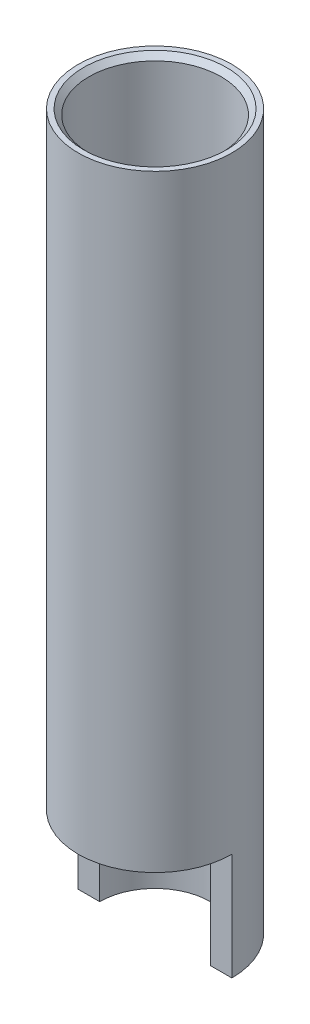
ISO-10303-21;
HEADER;
FILE_DESCRIPTION(('STEP AP214'),'2;1');
FILE_NAME('part.step','',(''),(''),'','','');
FILE_SCHEMA(('AUTOMOTIVE_DESIGN { 1 0 10303 214 1 1 1 1 }'));
ENDSEC;
DATA;
#1=APPLICATION_CONTEXT('core data for automotive mechanical design processes');
#2=APPLICATION_PROTOCOL_DEFINITION('international standard','automotive_design',2000,#1);
#3=PRODUCT_CONTEXT('',#1,'mechanical');
#4=PRODUCT('Part','Part','',(#3));
#5=PRODUCT_RELATED_PRODUCT_CATEGORY('part','',(#4));
#6=PRODUCT_DEFINITION_FORMATION('','',#4);
#7=PRODUCT_DEFINITION_CONTEXT('part definition',#1,'design');
#8=PRODUCT_DEFINITION('design','',#6,#7);
#9=PRODUCT_DEFINITION_SHAPE('','',#8);
#10=(LENGTH_UNIT() NAMED_UNIT(*) SI_UNIT(.MILLI.,.METRE.));
#11=(NAMED_UNIT(*) PLANE_ANGLE_UNIT() SI_UNIT($,.RADIAN.));
#12=(NAMED_UNIT(*) SI_UNIT($,.STERADIAN.) SOLID_ANGLE_UNIT());
#13=UNCERTAINTY_MEASURE_WITH_UNIT(LENGTH_MEASURE(1.E-05),#10,'distance_accuracy_value','');
#14=(GEOMETRIC_REPRESENTATION_CONTEXT(3) GLOBAL_UNCERTAINTY_ASSIGNED_CONTEXT((#13)) GLOBAL_UNIT_ASSIGNED_CONTEXT((#10,
#11,#12)) REPRESENTATION_CONTEXT('',''));
#15=CARTESIAN_POINT('',(0.,0.,0.));
#16=DIRECTION('',(0.,0.,1.));
#17=DIRECTION('',(1.,0.,0.));
#18=AXIS2_PLACEMENT_3D('',#15,#16,#17);
#19=CARTESIAN_POINT('',(1.55,0.,0.));
#20=DIRECTION('',(0.,-1.,0.));
#21=DIRECTION('',(0.,0.,-1.));
#22=AXIS2_PLACEMENT_3D('',#19,#20,#21);
#23=PLANE('',#22);
#24=DIRECTION('',(1.,0.,0.));
#25=VECTOR('',#24,1.);
#26=CARTESIAN_POINT('',(-2.39432512315271,0.,0.));
#27=LINE('',#26,#25);
#28=CARTESIAN_POINT('',(-2.15,0.,0.));
#29=VERTEX_POINT('',#28);
#30=CARTESIAN_POINT('',(-1.55,0.,0.));
#31=VERTEX_POINT('',#30);
#32=EDGE_CURVE('E78',#29,#31,#27,.T.);
#33=ORIENTED_EDGE('',*,*,#32,.F.);
#34=CARTESIAN_POINT('',(0.,0.,0.));
#35=DIRECTION('',(0.,-1.,0.));
#36=DIRECTION('',(0.,0.,-1.));
#37=AXIS2_PLACEMENT_3D('',#34,#35,#36);
#38=CIRCLE('',#37,2.15);
#39=CARTESIAN_POINT('',(2.15,0.,0.));
#40=VERTEX_POINT('',#39);
#41=EDGE_CURVE('E90',#29,#40,#38,.T.);
#42=ORIENTED_EDGE('',*,*,#41,.T.);
#43=CARTESIAN_POINT('',(1.55,0.,0.));
#44=VERTEX_POINT('',#43);
#45=EDGE_CURVE('E94',#44,#40,#27,.T.);
#46=ORIENTED_EDGE('',*,*,#45,.F.);
#47=CARTESIAN_POINT('',(0.,0.,0.));
#48=DIRECTION('',(0.,-1.,0.));
#49=DIRECTION('',(0.,0.,-1.));
#50=AXIS2_PLACEMENT_3D('',#47,#48,#49);
#51=CIRCLE('',#50,1.55);
#52=EDGE_CURVE('E92',#31,#44,#51,.T.);
#53=ORIENTED_EDGE('',*,*,#52,.F.);
#54=EDGE_LOOP('',(#33,#42,#46,#53));
#55=FACE_BOUND('',#54,.T.);
#56=ADVANCED_FACE('F32',(#55),#23,.T.);
#57=CARTESIAN_POINT('',(0.,4.,0.));
#58=DIRECTION('',(0.,-1.,0.));
#59=DIRECTION('',(0.,0.,-1.));
#60=AXIS2_PLACEMENT_3D('',#57,#58,#59);
#61=CYLINDRICAL_SURFACE('',#60,2.15);
#62=DIRECTION('',(0.,-1.,0.));
#63=VECTOR('',#62,1.);
#64=CARTESIAN_POINT('',(2.15,4.,0.));
#65=LINE('',#64,#63);
#66=CARTESIAN_POINT('',(2.15,3.,0.));
#67=VERTEX_POINT('',#66);
#68=EDGE_CURVE('E83',#40,#67,#65,.F.);
#69=ORIENTED_EDGE('',*,*,#68,.F.);
#70=ORIENTED_EDGE('',*,*,#41,.F.);
#71=DIRECTION('',(0.,-1.,0.));
#72=VECTOR('',#71,1.);
#73=CARTESIAN_POINT('',(-2.15,4.,0.));
#74=LINE('',#73,#72);
#75=CARTESIAN_POINT('',(-2.15,3.,0.));
#76=VERTEX_POINT('',#75);
#77=EDGE_CURVE('E75',#76,#29,#74,.T.);
#78=ORIENTED_EDGE('',*,*,#77,.F.);
#79=CARTESIAN_POINT('',(0.,3.,0.));
#80=DIRECTION('',(0.,-1.,0.));
#81=DIRECTION('',(0.,0.,-1.));
#82=AXIS2_PLACEMENT_3D('',#79,#80,#81);
#83=CIRCLE('',#82,2.15);
#84=EDGE_CURVE('E84',#76,#67,#83,.F.);
#85=ORIENTED_EDGE('',*,*,#84,.T.);
#86=EDGE_LOOP('',(#69,#70,#78,#85));
#87=FACE_BOUND('',#86,.T.);
#88=CARTESIAN_POINT('',(0.,20.,0.));
#89=DIRECTION('',(0.,-1.,0.));
#90=DIRECTION('',(0.,0.,-1.));
#91=AXIS2_PLACEMENT_3D('',#88,#89,#90);
#92=CIRCLE('',#91,2.15);
#93=CARTESIAN_POINT('',(0.,20.,-2.15));
#94=VERTEX_POINT('',#93);
#95=EDGE_CURVE('E100',#94,#94,#92,.T.);
#96=ORIENTED_EDGE('',*,*,#95,.T.);
#97=EDGE_LOOP('',(#96));
#98=FACE_BOUND('',#97,.T.);
#99=ADVANCED_FACE('F97',(#87,#98),#61,.T.);
#100=CARTESIAN_POINT('',(2.15,20.,0.));
#101=DIRECTION('',(0.,1.,0.));
#102=DIRECTION('',(0.,0.,1.));
#103=AXIS2_PLACEMENT_3D('',#100,#101,#102);
#104=PLANE('',#103);
#105=CARTESIAN_POINT('',(0.,20.,0.));
#106=DIRECTION('',(0.,1.,0.));
#107=DIRECTION('',(0.,0.,1.));
#108=AXIS2_PLACEMENT_3D('',#105,#106,#107);
#109=CIRCLE('',#108,2.);
#110=CARTESIAN_POINT('',(0.,20.,2.));
#111=VERTEX_POINT('',#110);
#112=EDGE_CURVE('E40',#111,#111,#109,.F.);
#113=ORIENTED_EDGE('',*,*,#112,.T.);
#114=EDGE_LOOP('',(#113));
#115=FACE_BOUND('',#114,.T.);
#116=ORIENTED_EDGE('',*,*,#95,.F.);
#117=EDGE_LOOP('',(#116));
#118=FACE_BOUND('',#117,.T.);
#119=ADVANCED_FACE('F112',(#115,#118),#104,.T.);
#120=CARTESIAN_POINT('',(0.,4.,0.));
#121=DIRECTION('',(0.,-1.,0.));
#122=DIRECTION('',(0.,0.,-1.));
#123=AXIS2_PLACEMENT_3D('',#120,#121,#122);
#124=CYLINDRICAL_SURFACE('',#123,1.85);
#125=CARTESIAN_POINT('',(0.,19.85,0.));
#126=DIRECTION('',(0.,1.,0.));
#127=DIRECTION('',(0.,0.,1.));
#128=AXIS2_PLACEMENT_3D('',#125,#126,#127);
#129=CIRCLE('',#128,1.85);
#130=CARTESIAN_POINT('',(0.,19.85,1.85));
#131=VERTEX_POINT('',#130);
#132=EDGE_CURVE('E11',#131,#131,#129,.T.);
#133=ORIENTED_EDGE('',*,*,#132,.T.);
#134=EDGE_LOOP('',(#133));
#135=FACE_BOUND('',#134,.T.);
#136=CARTESIAN_POINT('',(0.,11.,0.));
#137=DIRECTION('',(0.,-1.,0.));
#138=DIRECTION('',(0.,0.,-1.));
#139=AXIS2_PLACEMENT_3D('',#136,#137,#138);
#140=CIRCLE('',#139,1.85);
#141=CARTESIAN_POINT('',(0.,11.,-1.85));
#142=VERTEX_POINT('',#141);
#143=EDGE_CURVE('E105',#142,#142,#140,.T.);
#144=ORIENTED_EDGE('',*,*,#143,.T.);
#145=EDGE_LOOP('',(#144));
#146=FACE_BOUND('',#145,.T.);
#147=ADVANCED_FACE('F131',(#135,#146),#124,.F.);
#148=CARTESIAN_POINT('',(0.,11.,0.));
#149=DIRECTION('',(0.,1.,0.));
#150=DIRECTION('',(0.,0.,1.));
#151=AXIS2_PLACEMENT_3D('',#148,#149,#150);
#152=CONICAL_SURFACE('',#151,1.85,1.07524465330907);
#153=CARTESIAN_POINT('',(0.,10.,0.));
#154=VERTEX_POINT('',#153);
#155=VERTEX_LOOP('',#154);
#156=FACE_BOUND('',#155,.T.);
#157=ORIENTED_EDGE('',*,*,#143,.F.);
#158=EDGE_LOOP('',(#157));
#159=FACE_BOUND('',#158,.T.);
#160=ADVANCED_FACE('F134',(#156,#159),#152,.F.);
#161=CARTESIAN_POINT('',(0.,4.,0.));
#162=DIRECTION('',(0.,-1.,0.));
#163=DIRECTION('',(0.,0.,-1.));
#164=AXIS2_PLACEMENT_3D('',#161,#162,#163);
#165=CONICAL_SURFACE('',#164,0.,0.99783018390619);
#166=CARTESIAN_POINT('',(0.,3.,0.));
#167=DIRECTION('',(0.,-1.,0.));
#168=DIRECTION('',(0.,0.,-1.));
#169=AXIS2_PLACEMENT_3D('',#166,#167,#168);
#170=CIRCLE('',#169,1.55);
#171=CARTESIAN_POINT('',(1.55,3.,0.));
#172=VERTEX_POINT('',#171);
#173=CARTESIAN_POINT('',(-1.55,3.,0.));
#174=VERTEX_POINT('',#173);
#175=EDGE_CURVE('E160',#172,#174,#170,.T.);
#176=ORIENTED_EDGE('',*,*,#175,.T.);
#177=EDGE_CURVE('E165',#174,#172,#170,.T.);
#178=ORIENTED_EDGE('',*,*,#177,.T.);
#179=EDGE_LOOP('',(#176,#178));
#180=FACE_BOUND('',#179,.T.);
#181=CARTESIAN_POINT('',(0.,4.,0.));
#182=VERTEX_POINT('',#181);
#183=VERTEX_LOOP('',#182);
#184=FACE_BOUND('',#183,.T.);
#185=ADVANCED_FACE('F138',(#180,#184),#165,.F.);
#186=CARTESIAN_POINT('',(0.,4.,0.));
#187=DIRECTION('',(0.,-1.,0.));
#188=DIRECTION('',(0.,0.,-1.));
#189=AXIS2_PLACEMENT_3D('',#186,#187,#188);
#190=CYLINDRICAL_SURFACE('',#189,1.55);
#191=DIRECTION('',(0.,-1.,0.));
#192=VECTOR('',#191,1.);
#193=CARTESIAN_POINT('',(1.55,4.,0.));
#194=LINE('',#193,#192);
#195=EDGE_CURVE('E102',#172,#44,#194,.T.);
#196=ORIENTED_EDGE('',*,*,#195,.F.);
#197=ORIENTED_EDGE('',*,*,#177,.F.);
#198=DIRECTION('',(0.,-1.,0.));
#199=VECTOR('',#198,1.);
#200=CARTESIAN_POINT('',(-1.55,4.,0.));
#201=LINE('',#200,#199);
#202=EDGE_CURVE('E99',#31,#174,#201,.F.);
#203=ORIENTED_EDGE('',*,*,#202,.F.);
#204=ORIENTED_EDGE('',*,*,#52,.T.);
#205=EDGE_LOOP('',(#196,#197,#203,#204));
#206=FACE_BOUND('',#205,.T.);
#207=ADVANCED_FACE('F142',(#206),#190,.F.);
#208=CARTESIAN_POINT('',(-2.39432512315271,3.,0.));
#209=DIRECTION('',(0.,0.,-1.));
#210=DIRECTION('',(-1.,0.,0.));
#211=AXIS2_PLACEMENT_3D('',#208,#209,#210);
#212=PLANE('',#211);
#213=ORIENTED_EDGE('',*,*,#68,.T.);
#214=DIRECTION('',(1.,0.,0.));
#215=VECTOR('',#214,1.);
#216=CARTESIAN_POINT('',(-2.39432512315271,3.,0.));
#217=LINE('',#216,#215);
#218=EDGE_CURVE('E93',#172,#67,#217,.T.);
#219=ORIENTED_EDGE('',*,*,#218,.F.);
#220=ORIENTED_EDGE('',*,*,#195,.T.);
#221=ORIENTED_EDGE('',*,*,#45,.T.);
#222=EDGE_LOOP('',(#213,#219,#220,#221));
#223=FACE_BOUND('',#222,.T.);
#224=ADVANCED_FACE('F146',(#223),#212,.F.);
#225=ORIENTED_EDGE('',*,*,#77,.T.);
#226=ORIENTED_EDGE('',*,*,#32,.T.);
#227=ORIENTED_EDGE('',*,*,#202,.T.);
#228=EDGE_CURVE('E47',#76,#174,#217,.T.);
#229=ORIENTED_EDGE('',*,*,#228,.F.);
#230=EDGE_LOOP('',(#225,#226,#227,#229));
#231=FACE_BOUND('',#230,.T.);
#232=ADVANCED_FACE('F77',(#231),#212,.F.);
#233=CARTESIAN_POINT('',(0.,3.,0.));
#234=DIRECTION('',(0.,-1.,0.));
#235=DIRECTION('',(0.,0.,-1.));
#236=AXIS2_PLACEMENT_3D('',#233,#234,#235);
#237=PLANE('',#236);
#238=ORIENTED_EDGE('',*,*,#228,.T.);
#239=ORIENTED_EDGE('',*,*,#175,.F.);
#240=ORIENTED_EDGE('',*,*,#218,.T.);
#241=ORIENTED_EDGE('',*,*,#84,.F.);
#242=EDGE_LOOP('',(#238,#239,#240,#241));
#243=FACE_BOUND('',#242,.T.);
#244=ADVANCED_FACE('F116',(#243),#237,.T.);
#245=CARTESIAN_POINT('',(0.,20.,0.));
#246=DIRECTION('',(0.,1.,0.));
#247=DIRECTION('',(0.,0.,1.));
#248=AXIS2_PLACEMENT_3D('',#245,#246,#247);
#249=CONICAL_SURFACE('',#248,2.,0.785398163397444);
#250=ORIENTED_EDGE('',*,*,#132,.F.);
#251=EDGE_LOOP('',(#250));
#252=FACE_BOUND('',#251,.T.);
#253=ORIENTED_EDGE('',*,*,#112,.F.);
#254=EDGE_LOOP('',(#253));
#255=FACE_BOUND('',#254,.T.);
#256=ADVANCED_FACE('F34',(#252,#255),#249,.F.);
#257=CLOSED_SHELL('',(#56,#99,#119,#147,#160,#185,#207,#224,#232,#244,#256));
#258=MANIFOLD_SOLID_BREP('B2',#257);
#259=ADVANCED_BREP_SHAPE_REPRESENTATION('',(#18,#258),#14);
#260=SHAPE_DEFINITION_REPRESENTATION(#9,#259);
ENDSEC;
END-ISO-10303-21;
